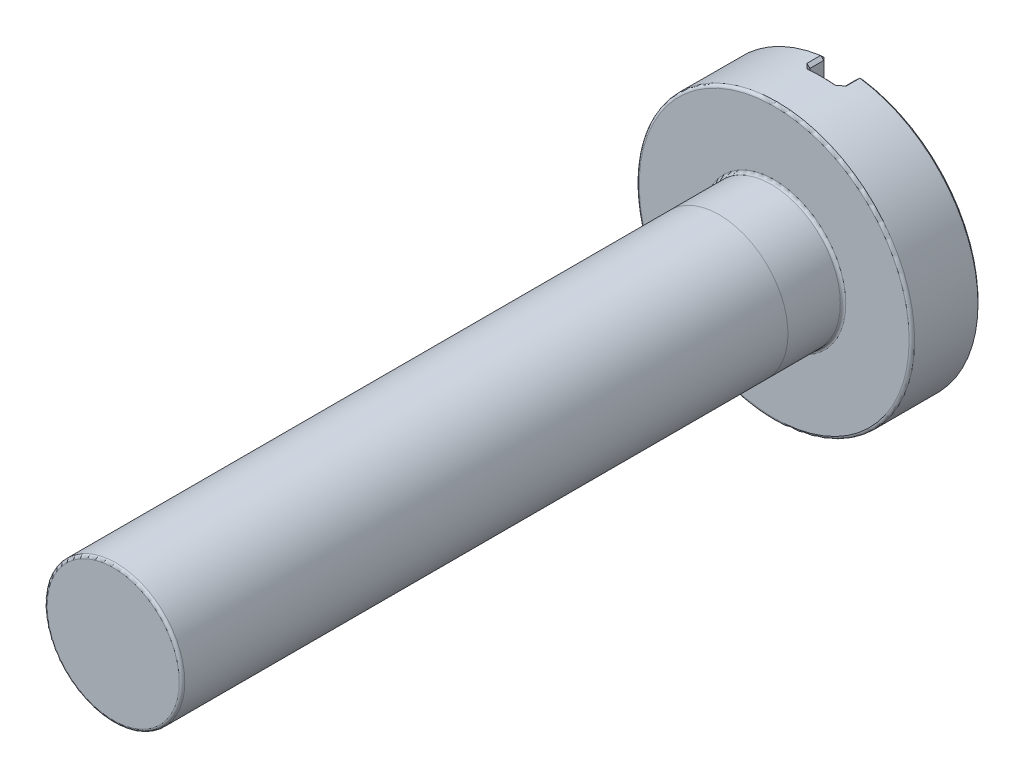
ISO-10303-21;
HEADER;
FILE_DESCRIPTION(('STEP AP214'),'2;1');
FILE_NAME('part.step','',(''),(''),'','','');
FILE_SCHEMA(('AUTOMOTIVE_DESIGN { 1 0 10303 214 1 1 1 1 }'));
ENDSEC;
DATA;
#1=APPLICATION_CONTEXT('core data for automotive mechanical design processes');
#2=APPLICATION_PROTOCOL_DEFINITION('international standard','automotive_design',2000,#1);
#3=PRODUCT_CONTEXT('',#1,'mechanical');
#4=PRODUCT('Part','Part','',(#3));
#5=PRODUCT_RELATED_PRODUCT_CATEGORY('part','',(#4));
#6=PRODUCT_DEFINITION_FORMATION('','',#4);
#7=PRODUCT_DEFINITION_CONTEXT('part definition',#1,'design');
#8=PRODUCT_DEFINITION('design','',#6,#7);
#9=PRODUCT_DEFINITION_SHAPE('','',#8);
#10=(LENGTH_UNIT() NAMED_UNIT(*) SI_UNIT(.MILLI.,.METRE.));
#11=(NAMED_UNIT(*) PLANE_ANGLE_UNIT() SI_UNIT($,.RADIAN.));
#12=(NAMED_UNIT(*) SI_UNIT($,.STERADIAN.) SOLID_ANGLE_UNIT());
#13=UNCERTAINTY_MEASURE_WITH_UNIT(LENGTH_MEASURE(1.E-05),#10,'distance_accuracy_value','');
#14=(GEOMETRIC_REPRESENTATION_CONTEXT(3) GLOBAL_UNCERTAINTY_ASSIGNED_CONTEXT((#13)) GLOBAL_UNIT_ASSIGNED_CONTEXT((#10,
#11,#12)) REPRESENTATION_CONTEXT('',''));
#15=CARTESIAN_POINT('',(0.,0.,0.));
#16=DIRECTION('',(0.,0.,1.));
#17=DIRECTION('',(1.,0.,0.));
#18=AXIS2_PLACEMENT_3D('',#15,#16,#17);
#19=CARTESIAN_POINT('',(0.,0.,12.));
#20=DIRECTION('',(0.,0.,-1.));
#21=DIRECTION('',(-1.,0.,0.));
#22=AXIS2_PLACEMENT_3D('',#19,#20,#21);
#23=CYLINDRICAL_SURFACE('',#22,1.25);
#24=CARTESIAN_POINT('',(0.,0.,11.95));
#25=DIRECTION('',(0.,0.,1.));
#26=DIRECTION('',(1.,0.,0.));
#27=AXIS2_PLACEMENT_3D('',#24,#25,#26);
#28=CIRCLE('',#27,1.25);
#29=CARTESIAN_POINT('',(1.25,0.,11.95));
#30=VERTEX_POINT('',#29);
#31=EDGE_CURVE('E55',#30,#30,#28,.F.);
#32=ORIENTED_EDGE('',*,*,#31,.T.);
#33=EDGE_LOOP('',(#32));
#34=FACE_BOUND('',#33,.T.);
#35=CARTESIAN_POINT('',(0.,0.,1.));
#36=DIRECTION('',(0.,0.,-1.));
#37=DIRECTION('',(0.,1.,0.));
#38=AXIS2_PLACEMENT_3D('',#35,#36,#37);
#39=CIRCLE('',#38,1.25);
#40=CARTESIAN_POINT('',(0.,1.25,1.));
#41=VERTEX_POINT('',#40);
#42=EDGE_CURVE('E11',#41,#41,#39,.T.);
#43=ORIENTED_EDGE('',*,*,#42,.F.);
#44=EDGE_LOOP('',(#43));
#45=FACE_BOUND('',#44,.T.);
#46=ADVANCED_FACE('F46',(#34,#45),#23,.T.);
#47=CARTESIAN_POINT('',(0.,0.,-1.25));
#48=DIRECTION('',(0.,0.,1.));
#49=DIRECTION('',(1.,0.,0.));
#50=AXIS2_PLACEMENT_3D('',#47,#48,#49);
#51=CYLINDRICAL_SURFACE('',#50,2.5);
#52=CARTESIAN_POINT('',(0.,0.,-0.0499999999999999));
#53=DIRECTION('',(0.,0.,1.));
#54=DIRECTION('',(1.,0.,0.));
#55=AXIS2_PLACEMENT_3D('',#52,#53,#54);
#56=CIRCLE('',#55,2.5);
#57=CARTESIAN_POINT('',(2.5,0.,-0.0499999999999999));
#58=VERTEX_POINT('',#57);
#59=EDGE_CURVE('E514',#58,#58,#56,.F.);
#60=ORIENTED_EDGE('',*,*,#59,.T.);
#61=EDGE_LOOP('',(#60));
#62=FACE_BOUND('',#61,.T.);
#63=CARTESIAN_POINT('',(-0.357142857142859,2.47435829652697,-0.950000000000001));
#64=CARTESIAN_POINT('',(-0.348283128722045,2.47563702333072,-0.941134122382787));
#65=CARTESIAN_POINT('',(-0.339398611806157,2.47687086598076,-0.932286484523355));
#66=CARTESIAN_POINT('',(-0.321576086205338,2.47924782192304,-0.914632993380492));
#67=CARTESIAN_POINT('',(-0.312638077482019,2.48039093515016,-0.905827140127055));
#68=CARTESIAN_POINT('',(-0.287577804069123,2.48345759248477,-0.881282240398703));
#69=CARTESIAN_POINT('',(-0.271391793277397,2.48527929599137,-0.865595509519482));
#70=CARTESIAN_POINT('',(-0.25510204081875,2.48695053203223,-0.850000000001686));
#71=B_SPLINE_CURVE_WITH_KNOTS('',3,(#63,#64,#65,#66,#67,#68,#69,#70),.UNSPECIFIED.,.F.,.F.,(4,2,
2,4),(0.,0.0377968117810585,0.0755936506896943,0.143431941871321),.UNSPECIFIED.);
#72=CARTESIAN_POINT('',(-0.357142857142859,2.47435829652697,-0.950000000000001));
#73=VERTEX_POINT('',#72);
#74=CARTESIAN_POINT('',(-0.255102040816325,2.48695053203142,-0.849999999999999));
#75=VERTEX_POINT('',#74);
#76=EDGE_CURVE('E261',#73,#75,#71,.T.);
#77=ORIENTED_EDGE('',*,*,#76,.F.);
#78=DIRECTION('',(0.,0.,1.));
#79=VECTOR('',#78,1.);
#80=CARTESIAN_POINT('',(-0.357142857142859,2.47435829652697,-1.25));
#81=LINE('',#80,#79);
#82=CARTESIAN_POINT('',(-0.357142857142859,2.47435829652697,-1.2));
#83=VERTEX_POINT('',#82);
#84=EDGE_CURVE('E259',#73,#83,#81,.F.);
#85=ORIENTED_EDGE('',*,*,#84,.T.);
#86=CARTESIAN_POINT('',(0.,0.,-1.2));
#87=DIRECTION('',(0.,0.,1.));
#88=DIRECTION('',(1.,0.,0.));
#89=AXIS2_PLACEMENT_3D('',#86,#87,#88);
#90=CIRCLE('',#89,2.5);
#91=CARTESIAN_POINT('',(-0.357142857142859,-2.47435829652697,-1.2));
#92=VERTEX_POINT('',#91);
#93=EDGE_CURVE('E255',#83,#92,#90,.T.);
#94=ORIENTED_EDGE('',*,*,#93,.T.);
#95=DIRECTION('',(0.,0.,1.));
#96=VECTOR('',#95,1.);
#97=CARTESIAN_POINT('',(-0.357142857142859,-2.47435829652697,-1.25));
#98=LINE('',#97,#96);
#99=CARTESIAN_POINT('',(-0.357142857142859,-2.47435829652697,-0.950000000000001));
#100=VERTEX_POINT('',#99);
#101=EDGE_CURVE('E155',#92,#100,#98,.T.);
#102=ORIENTED_EDGE('',*,*,#101,.T.);
#103=CARTESIAN_POINT('',(-0.255102040816325,-2.48695053203142,-0.849999999999999));
#104=CARTESIAN_POINT('',(-0.264178191386565,-2.48601946587719,-0.858688711502498));
#105=CARTESIAN_POINT('',(-0.273221965792444,-2.48504163410855,-0.86740607020343));
#106=CARTESIAN_POINT('',(-0.291248879878858,-2.4829934567889,-0.884892451642306));
#107=CARTESIAN_POINT('',(-0.300232019629449,-2.4819231113448,-0.893661474320537));
#108=CARTESIAN_POINT('',(-0.325259245581334,-2.47880383809922,-0.918233587454576));
#109=CARTESIAN_POINT('',(-0.34124058304598,-2.47665328543805,-0.934087828582102));
#110=CARTESIAN_POINT('',(-0.357142857142859,-2.47435829652697,-0.950000000000001));
#111=B_SPLINE_CURVE_WITH_KNOTS('',3,(#103,#104,#105,#106,#107,#108,#109,#110),.UNSPECIFIED.,.F.,
.F.,(4,2,2,4),(0.,0.0377969208692554,0.0755937980612079,0.143432033029298),.UNSPECIFIED.);
#112=CARTESIAN_POINT('',(-0.255102040816325,-2.48695053203142,-0.849999999999999));
#113=VERTEX_POINT('',#112);
#114=EDGE_CURVE('E247',#113,#100,#111,.T.);
#115=ORIENTED_EDGE('',*,*,#114,.F.);
#116=CARTESIAN_POINT('',(0.,0.,-0.849999999999999));
#117=DIRECTION('',(0.,0.,-1.));
#118=DIRECTION('',(-1.,0.,0.));
#119=AXIS2_PLACEMENT_3D('',#116,#117,#118);
#120=CIRCLE('',#119,2.5);
#121=CARTESIAN_POINT('',(0.255102040816325,-2.48695053203142,-0.849999999999999));
#122=VERTEX_POINT('',#121);
#123=EDGE_CURVE('E203',#113,#122,#120,.F.);
#124=ORIENTED_EDGE('',*,*,#123,.T.);
#125=CARTESIAN_POINT('',(0.357142857142859,-2.47435829652697,-0.950000000000001));
#126=CARTESIAN_POINT('',(0.348283128722045,-2.47563702333072,-0.941134122382787));
#127=CARTESIAN_POINT('',(0.339398611806157,-2.47687086598076,-0.932286484523355));
#128=CARTESIAN_POINT('',(0.321576086205338,-2.47924782192304,-0.914632993380492));
#129=CARTESIAN_POINT('',(0.312638077482019,-2.48039093515016,-0.905827140127055));
#130=CARTESIAN_POINT('',(0.287577804069123,-2.48345759248477,-0.881282240398703));
#131=CARTESIAN_POINT('',(0.271391793277397,-2.48527929599137,-0.865595509519482));
#132=CARTESIAN_POINT('',(0.25510204081875,-2.48695053203223,-0.850000000001686));
#133=B_SPLINE_CURVE_WITH_KNOTS('',3,(#125,#126,#127,#128,#129,#130,#131,#132),.UNSPECIFIED.,.F.,
.F.,(4,2,2,4),(0.,0.0377968117810585,0.0755936506896943,0.143431941871321),.UNSPECIFIED.);
#134=CARTESIAN_POINT('',(0.357142857142859,-2.47435829652697,-0.950000000000001));
#135=VERTEX_POINT('',#134);
#136=EDGE_CURVE('E194',#135,#122,#133,.T.);
#137=ORIENTED_EDGE('',*,*,#136,.F.);
#138=DIRECTION('',(0.,0.,1.));
#139=VECTOR('',#138,1.);
#140=CARTESIAN_POINT('',(0.357142857142859,-2.47435829652697,-1.25));
#141=LINE('',#140,#139);
#142=CARTESIAN_POINT('',(0.357142857142859,-2.47435829652697,-1.2));
#143=VERTEX_POINT('',#142);
#144=EDGE_CURVE('E192',#135,#143,#141,.F.);
#145=ORIENTED_EDGE('',*,*,#144,.T.);
#146=CARTESIAN_POINT('',(0.,0.,-1.2));
#147=DIRECTION('',(0.,0.,1.));
#148=DIRECTION('',(1.,0.,0.));
#149=AXIS2_PLACEMENT_3D('',#146,#147,#148);
#150=CIRCLE('',#149,2.5);
#151=CARTESIAN_POINT('',(0.357142857142859,2.47435829652697,-1.2));
#152=VERTEX_POINT('',#151);
#153=EDGE_CURVE('E185',#143,#152,#150,.T.);
#154=ORIENTED_EDGE('',*,*,#153,.T.);
#155=DIRECTION('',(0.,0.,1.));
#156=VECTOR('',#155,1.);
#157=CARTESIAN_POINT('',(0.357142857142859,2.47435829652697,-1.25));
#158=LINE('',#157,#156);
#159=CARTESIAN_POINT('',(0.357142857142859,2.47435829652697,-0.950000000000001));
#160=VERTEX_POINT('',#159);
#161=EDGE_CURVE('E190',#152,#160,#158,.T.);
#162=ORIENTED_EDGE('',*,*,#161,.T.);
#163=CARTESIAN_POINT('',(0.255102040816325,2.48695053203142,-0.849999999999999));
#164=CARTESIAN_POINT('',(0.264178191386565,2.48601946587719,-0.858688711502498));
#165=CARTESIAN_POINT('',(0.273221965792444,2.48504163410855,-0.86740607020343));
#166=CARTESIAN_POINT('',(0.291248879878858,2.4829934567889,-0.884892451642306));
#167=CARTESIAN_POINT('',(0.300232019629449,2.4819231113448,-0.893661474320537));
#168=CARTESIAN_POINT('',(0.325259245581334,2.47880383809922,-0.918233587454576));
#169=CARTESIAN_POINT('',(0.34124058304598,2.47665328543805,-0.934087828582102));
#170=CARTESIAN_POINT('',(0.357142857142859,2.47435829652697,-0.950000000000001));
#171=B_SPLINE_CURVE_WITH_KNOTS('',3,(#163,#164,#165,#166,#167,#168,#169,#170),.UNSPECIFIED.,.F.,
.F.,(4,2,2,4),(0.,0.0377969208692554,0.0755937980612079,0.143432033029298),.UNSPECIFIED.);
#172=CARTESIAN_POINT('',(0.255102040816325,2.48695053203142,-0.849999999999999));
#173=VERTEX_POINT('',#172);
#174=EDGE_CURVE('E240',#173,#160,#171,.T.);
#175=ORIENTED_EDGE('',*,*,#174,.F.);
#176=CARTESIAN_POINT('',(0.,0.,-0.849999999999999));
#177=DIRECTION('',(0.,0.,-1.));
#178=DIRECTION('',(-1.,0.,0.));
#179=AXIS2_PLACEMENT_3D('',#176,#177,#178);
#180=CIRCLE('',#179,2.5);
#181=EDGE_CURVE('E257',#173,#75,#180,.F.);
#182=ORIENTED_EDGE('',*,*,#181,.T.);
#183=EDGE_LOOP('',(#77,#85,#94,#102,#115,#124,#137,#145,#154,#162,#175,#182));
#184=FACE_BOUND('',#183,.T.);
#185=ADVANCED_FACE('F205',(#62,#184),#51,.T.);
#186=CARTESIAN_POINT('',(0.,0.,-1.25));
#187=DIRECTION('',(0.,0.,1.));
#188=DIRECTION('',(1.,0.,0.));
#189=AXIS2_PLACEMENT_3D('',#186,#187,#188);
#190=PLANE('',#189);
#191=CARTESIAN_POINT('',(0.,0.,-1.25));
#192=DIRECTION('',(0.,0.,1.));
#193=DIRECTION('',(1.,0.,0.));
#194=AXIS2_PLACEMENT_3D('',#191,#192,#193);
#195=CIRCLE('',#194,2.45);
#196=CARTESIAN_POINT('',(0.350000000000001,2.42487113059643,-1.25));
#197=VERTEX_POINT('',#196);
#198=CARTESIAN_POINT('',(0.350000000000001,-2.42487113059643,-1.25));
#199=VERTEX_POINT('',#198);
#200=EDGE_CURVE('E61',#197,#199,#195,.F.);
#201=ORIENTED_EDGE('',*,*,#200,.T.);
#202=DIRECTION('',(0.,1.,0.));
#203=VECTOR('',#202,1.);
#204=CARTESIAN_POINT('',(0.350000000000001,0.,-1.25));
#205=LINE('',#204,#203);
#206=EDGE_CURVE('E530',#199,#197,#205,.T.);
#207=ORIENTED_EDGE('',*,*,#206,.T.);
#208=EDGE_LOOP('',(#201,#207));
#209=FACE_BOUND('',#208,.T.);
#210=ADVANCED_FACE('F494',(#209),#190,.F.);
#211=ORIENTED_EDGE('',*,*,#42,.T.);
#212=EDGE_LOOP('',(#211));
#213=FACE_BOUND('',#212,.T.);
#214=CARTESIAN_POINT('',(0.,0.,0.0499999999999997));
#215=DIRECTION('',(0.,0.,1.));
#216=DIRECTION('',(1.,0.,0.));
#217=AXIS2_PLACEMENT_3D('',#214,#215,#216);
#218=CIRCLE('',#217,1.25);
#219=CARTESIAN_POINT('',(1.25,0.,0.0499999999999997));
#220=VERTEX_POINT('',#219);
#221=EDGE_CURVE('E512',#220,#220,#218,.T.);
#222=ORIENTED_EDGE('',*,*,#221,.T.);
#223=EDGE_LOOP('',(#222));
#224=FACE_BOUND('',#223,.T.);
#225=ADVANCED_FACE('F218',(#213,#224),#23,.T.);
#226=CARTESIAN_POINT('',(0.,0.,12.));
#227=DIRECTION('',(0.,0.,1.));
#228=DIRECTION('',(1.,0.,0.));
#229=AXIS2_PLACEMENT_3D('',#226,#227,#228);
#230=PLANE('',#229);
#231=CARTESIAN_POINT('',(0.,0.,12.));
#232=DIRECTION('',(0.,0.,1.));
#233=DIRECTION('',(1.,0.,0.));
#234=AXIS2_PLACEMENT_3D('',#231,#232,#233);
#235=CIRCLE('',#234,1.2);
#236=CARTESIAN_POINT('',(1.2,0.,12.));
#237=VERTEX_POINT('',#236);
#238=EDGE_CURVE('E513',#237,#237,#235,.T.);
#239=ORIENTED_EDGE('',*,*,#238,.T.);
#240=EDGE_LOOP('',(#239));
#241=FACE_BOUND('',#240,.T.);
#242=ADVANCED_FACE('F499',(#241),#230,.T.);
#243=CARTESIAN_POINT('',(0.,0.,-1.25));
#244=DIRECTION('',(0.,0.,1.));
#245=DIRECTION('',(1.,0.,0.));
#246=AXIS2_PLACEMENT_3D('',#243,#244,#245);
#247=CIRCLE('',#246,2.45);
#248=CARTESIAN_POINT('',(-0.350000000000001,-2.42487113059643,-1.25));
#249=VERTEX_POINT('',#248);
#250=CARTESIAN_POINT('',(-0.350000000000001,2.42487113059643,-1.25));
#251=VERTEX_POINT('',#250);
#252=EDGE_CURVE('E593',#249,#251,#247,.F.);
#253=ORIENTED_EDGE('',*,*,#252,.T.);
#254=DIRECTION('',(0.,-1.,0.));
#255=VECTOR('',#254,1.);
#256=CARTESIAN_POINT('',(-0.350000000000001,0.,-1.25));
#257=LINE('',#256,#255);
#258=EDGE_CURVE('E600',#251,#249,#257,.T.);
#259=ORIENTED_EDGE('',*,*,#258,.T.);
#260=EDGE_LOOP('',(#253,#259));
#261=FACE_BOUND('',#260,.T.);
#262=ADVANCED_FACE('F505',(#261),#190,.F.);
#263=CARTESIAN_POINT('',(0.,0.,0.));
#264=DIRECTION('',(0.,0.,1.));
#265=DIRECTION('',(1.,0.,0.));
#266=AXIS2_PLACEMENT_3D('',#263,#264,#265);
#267=PLANE('',#266);
#268=CARTESIAN_POINT('',(0.,0.,0.));
#269=DIRECTION('',(0.,0.,1.));
#270=DIRECTION('',(1.,0.,0.));
#271=AXIS2_PLACEMENT_3D('',#268,#269,#270);
#272=CIRCLE('',#271,2.45);
#273=CARTESIAN_POINT('',(2.45,0.,0.));
#274=VERTEX_POINT('',#273);
#275=EDGE_CURVE('E519',#274,#274,#272,.T.);
#276=ORIENTED_EDGE('',*,*,#275,.T.);
#277=EDGE_LOOP('',(#276));
#278=FACE_BOUND('',#277,.T.);
#279=CARTESIAN_POINT('',(0.,0.,0.));
#280=DIRECTION('',(0.,0.,1.));
#281=DIRECTION('',(1.,0.,0.));
#282=AXIS2_PLACEMENT_3D('',#279,#280,#281);
#283=CIRCLE('',#282,1.3);
#284=CARTESIAN_POINT('',(1.3,0.,0.));
#285=VERTEX_POINT('',#284);
#286=EDGE_CURVE('E527',#285,#285,#283,.F.);
#287=ORIENTED_EDGE('',*,*,#286,.T.);
#288=EDGE_LOOP('',(#287));
#289=FACE_BOUND('',#288,.T.);
#290=ADVANCED_FACE('F617',(#278,#289),#267,.T.);
#291=CARTESIAN_POINT('',(0.3,-3.72872824867462,-0.9));
#292=DIRECTION('',(1.,0.,0.));
#293=DIRECTION('',(0.,0.,-1.));
#294=AXIS2_PLACEMENT_3D('',#291,#292,#293);
#295=PLANE('',#294);
#296=DIRECTION('',(0.,0.,1.));
#297=VECTOR('',#296,1.);
#298=CARTESIAN_POINT('',(0.3,-2.42487113059643,-0.9));
#299=LINE('',#298,#297);
#300=CARTESIAN_POINT('',(0.3,-2.42487113059643,-1.2));
#301=VERTEX_POINT('',#300);
#302=CARTESIAN_POINT('',(0.3,-2.42487113059643,-0.950000000000001));
#303=VERTEX_POINT('',#302);
#304=EDGE_CURVE('E554',#301,#303,#299,.T.);
#305=ORIENTED_EDGE('',*,*,#304,.T.);
#306=DIRECTION('',(0.,1.,0.));
#307=VECTOR('',#306,1.);
#308=CARTESIAN_POINT('',(0.3,-3.72872824867462,-0.950000000000001));
#309=LINE('',#308,#307);
#310=CARTESIAN_POINT('',(0.3,2.42487113059643,-0.950000000000001));
#311=VERTEX_POINT('',#310);
#312=EDGE_CURVE('E955',#303,#311,#309,.T.);
#313=ORIENTED_EDGE('',*,*,#312,.T.);
#314=DIRECTION('',(0.,0.,-1.));
#315=VECTOR('',#314,1.);
#316=CARTESIAN_POINT('',(0.3,2.42487113059643,-1.25));
#317=LINE('',#316,#315);
#318=CARTESIAN_POINT('',(0.3,2.42487113059643,-1.2));
#319=VERTEX_POINT('',#318);
#320=EDGE_CURVE('E958',#311,#319,#317,.T.);
#321=ORIENTED_EDGE('',*,*,#320,.T.);
#322=DIRECTION('',(0.,-1.,0.));
#323=VECTOR('',#322,1.);
#324=CARTESIAN_POINT('',(0.3,-3.72872824867462,-1.2));
#325=LINE('',#324,#323);
#326=EDGE_CURVE('E268',#319,#301,#325,.T.);
#327=ORIENTED_EDGE('',*,*,#326,.T.);
#328=EDGE_LOOP('',(#305,#313,#321,#327));
#329=FACE_BOUND('',#328,.T.);
#330=ADVANCED_FACE('F621',(#329),#295,.F.);
#331=CARTESIAN_POINT('',(-0.3,-3.72872824867462,-0.9));
#332=DIRECTION('',(-1.,0.,0.));
#333=DIRECTION('',(0.,0.,1.));
#334=AXIS2_PLACEMENT_3D('',#331,#332,#333);
#335=PLANE('',#334);
#336=DIRECTION('',(0.,0.,1.));
#337=VECTOR('',#336,1.);
#338=CARTESIAN_POINT('',(-0.3,2.42487113059643,-0.9));
#339=LINE('',#338,#337);
#340=CARTESIAN_POINT('',(-0.3,2.42487113059643,-1.2));
#341=VERTEX_POINT('',#340);
#342=CARTESIAN_POINT('',(-0.3,2.42487113059643,-0.950000000000001));
#343=VERTEX_POINT('',#342);
#344=EDGE_CURVE('E177',#341,#343,#339,.T.);
#345=ORIENTED_EDGE('',*,*,#344,.T.);
#346=DIRECTION('',(0.,-1.,0.));
#347=VECTOR('',#346,1.);
#348=CARTESIAN_POINT('',(-0.3,-3.72872824867462,-0.950000000000001));
#349=LINE('',#348,#347);
#350=CARTESIAN_POINT('',(-0.3,-2.42487113059643,-0.950000000000001));
#351=VERTEX_POINT('',#350);
#352=EDGE_CURVE('E182',#343,#351,#349,.T.);
#353=ORIENTED_EDGE('',*,*,#352,.T.);
#354=DIRECTION('',(0.,0.,-1.));
#355=VECTOR('',#354,1.);
#356=CARTESIAN_POINT('',(-0.3,-2.42487113059643,-1.25));
#357=LINE('',#356,#355);
#358=CARTESIAN_POINT('',(-0.3,-2.42487113059643,-1.2));
#359=VERTEX_POINT('',#358);
#360=EDGE_CURVE('E153',#351,#359,#357,.T.);
#361=ORIENTED_EDGE('',*,*,#360,.T.);
#362=DIRECTION('',(0.,1.,0.));
#363=VECTOR('',#362,1.);
#364=CARTESIAN_POINT('',(-0.3,-3.72872824867462,-1.2));
#365=LINE('',#364,#363);
#366=EDGE_CURVE('E171',#359,#341,#365,.T.);
#367=ORIENTED_EDGE('',*,*,#366,.T.);
#368=EDGE_LOOP('',(#345,#353,#361,#367));
#369=FACE_BOUND('',#368,.T.);
#370=ADVANCED_FACE('F180',(#369),#335,.F.);
#371=CARTESIAN_POINT('',(0.,0.,-0.9));
#372=DIRECTION('',(0.,0.,-1.));
#373=DIRECTION('',(-1.,0.,0.));
#374=AXIS2_PLACEMENT_3D('',#371,#372,#373);
#375=PLANE('',#374);
#376=DIRECTION('',(0.,-1.,0.));
#377=VECTOR('',#376,1.);
#378=CARTESIAN_POINT('',(0.249999999999999,0.,-0.9));
#379=LINE('',#378,#377);
#380=CARTESIAN_POINT('',(0.249999999999999,2.43721152139079,-0.9));
#381=VERTEX_POINT('',#380);
#382=CARTESIAN_POINT('',(0.249999999999999,-2.43721152139079,-0.9));
#383=VERTEX_POINT('',#382);
#384=EDGE_CURVE('E590',#381,#383,#379,.T.);
#385=ORIENTED_EDGE('',*,*,#384,.T.);
#386=CARTESIAN_POINT('',(0.,0.,-0.9));
#387=DIRECTION('',(0.,0.,-1.));
#388=DIRECTION('',(-1.,0.,0.));
#389=AXIS2_PLACEMENT_3D('',#386,#387,#388);
#390=CIRCLE('',#389,2.45);
#391=CARTESIAN_POINT('',(-0.249999999999999,-2.43721152139079,-0.9));
#392=VERTEX_POINT('',#391);
#393=EDGE_CURVE('E569',#383,#392,#390,.T.);
#394=ORIENTED_EDGE('',*,*,#393,.T.);
#395=DIRECTION('',(0.,1.,0.));
#396=VECTOR('',#395,1.);
#397=CARTESIAN_POINT('',(-0.249999999999999,0.,-0.9));
#398=LINE('',#397,#396);
#399=CARTESIAN_POINT('',(-0.249999999999999,2.43721152139079,-0.9));
#400=VERTEX_POINT('',#399);
#401=EDGE_CURVE('E595',#392,#400,#398,.T.);
#402=ORIENTED_EDGE('',*,*,#401,.T.);
#403=CARTESIAN_POINT('',(0.,0.,-0.9));
#404=DIRECTION('',(0.,0.,-1.));
#405=DIRECTION('',(-1.,0.,0.));
#406=AXIS2_PLACEMENT_3D('',#403,#404,#405);
#407=CIRCLE('',#406,2.45);
#408=EDGE_CURVE('E587',#400,#381,#407,.T.);
#409=ORIENTED_EDGE('',*,*,#408,.T.);
#410=EDGE_LOOP('',(#385,#394,#402,#409));
#411=FACE_BOUND('',#410,.T.);
#412=ADVANCED_FACE('F476',(#411),#375,.T.);
#413=CARTESIAN_POINT('',(0.3,2.42487113059643,-1.2));
#414=DIRECTION('',(-0.547722557505162,0.632455532033675,-0.547722557505171));
#415=DIRECTION('',(0.,0.654653670707981,0.755928946018451));
#416=AXIS2_PLACEMENT_3D('',#413,#414,#415);
#417=PLANE('',#416);
#418=DIRECTION('',(0.755928946018456,0.654653670707975,0.));
#419=VECTOR('',#418,1.);
#420=CARTESIAN_POINT('',(0.3,2.42487113059643,-1.2));
#421=LINE('',#420,#419);
#422=EDGE_CURVE('E535',#152,#319,#421,.F.);
#423=ORIENTED_EDGE('',*,*,#422,.F.);
#424=DIRECTION('',(-0.101015254455233,-0.699854212223773,-0.707106781186538));
#425=VECTOR('',#424,1.);
#426=CARTESIAN_POINT('',(0.,0.,-3.69999999999995));
#427=LINE('',#426,#425);
#428=EDGE_CURVE('E178',#197,#152,#427,.F.);
#429=ORIENTED_EDGE('',*,*,#428,.F.);
#430=DIRECTION('',(0.707106781186557,0.,-0.707106781186538));
#431=VECTOR('',#430,1.);
#432=CARTESIAN_POINT('',(0.3,2.42487113059643,-1.2));
#433=LINE('',#432,#431);
#434=EDGE_CURVE('E532',#319,#197,#433,.T.);
#435=ORIENTED_EDGE('',*,*,#434,.F.);
#436=EDGE_LOOP('',(#423,#429,#435));
#437=FACE_BOUND('',#436,.T.);
#438=ADVANCED_FACE('F471',(#437),#417,.T.);
#439=CARTESIAN_POINT('',(0.,0.,-1.2));
#440=DIRECTION('',(0.,0.,1.));
#441=DIRECTION('',(1.,0.,0.));
#442=AXIS2_PLACEMENT_3D('',#439,#440,#441);
#443=CONICAL_SURFACE('',#442,2.5,0.785398163397461);
#444=ORIENTED_EDGE('',*,*,#428,.T.);
#445=ORIENTED_EDGE('',*,*,#153,.F.);
#446=DIRECTION('',(0.101015254455233,-0.699854212223773,0.707106781186538));
#447=VECTOR('',#446,1.);
#448=CARTESIAN_POINT('',(0.,0.,-3.69999999999995));
#449=LINE('',#448,#447);
#450=EDGE_CURVE('E538',#199,#143,#449,.T.);
#451=ORIENTED_EDGE('',*,*,#450,.F.);
#452=ORIENTED_EDGE('',*,*,#200,.F.);
#453=EDGE_LOOP('',(#444,#445,#451,#452));
#454=FACE_BOUND('',#453,.T.);
#455=ADVANCED_FACE('F465',(#454),#443,.T.);
#456=CARTESIAN_POINT('',(0.350000000000001,0.,-1.25));
#457=DIRECTION('',(0.707106781186538,0.,0.707106781186557));
#458=DIRECTION('',(0.,1.,0.));
#459=AXIS2_PLACEMENT_3D('',#456,#457,#458);
#460=PLANE('',#459);
#461=ORIENTED_EDGE('',*,*,#434,.T.);
#462=ORIENTED_EDGE('',*,*,#206,.F.);
#463=DIRECTION('',(-0.707106781186557,0.,0.707106781186538));
#464=VECTOR('',#463,1.);
#465=CARTESIAN_POINT('',(0.32857142857143,-2.42487113059643,-1.22857142857143));
#466=LINE('',#465,#464);
#467=EDGE_CURVE('E541',#301,#199,#466,.F.);
#468=ORIENTED_EDGE('',*,*,#467,.F.);
#469=ORIENTED_EDGE('',*,*,#326,.F.);
#470=EDGE_LOOP('',(#461,#462,#468,#469));
#471=FACE_BOUND('',#470,.T.);
#472=ADVANCED_FACE('F458',(#471),#460,.F.);
#473=CARTESIAN_POINT('',(0.3,2.42487113059643,-1.25));
#474=DIRECTION('',(-0.654653670707975,0.755928946018456,0.));
#475=DIRECTION('',(0.,0.,1.));
#476=AXIS2_PLACEMENT_3D('',#473,#474,#475);
#477=PLANE('',#476);
#478=ORIENTED_EDGE('',*,*,#422,.T.);
#479=ORIENTED_EDGE('',*,*,#320,.F.);
#480=DIRECTION('',(-0.755928946018456,-0.654653670707975,0.));
#481=VECTOR('',#480,1.);
#482=CARTESIAN_POINT('',(0.357142857142859,2.47435829652697,-0.950000000000001));
#483=LINE('',#482,#481);
#484=EDGE_CURVE('E543',#160,#311,#483,.T.);
#485=ORIENTED_EDGE('',*,*,#484,.F.);
#486=ORIENTED_EDGE('',*,*,#161,.F.);
#487=EDGE_LOOP('',(#478,#479,#485,#486));
#488=FACE_BOUND('',#487,.T.);
#489=ADVANCED_FACE('F451',(#488),#477,.T.);
#490=CARTESIAN_POINT('',(0.357142857142859,-2.47435829652697,-1.2));
#491=DIRECTION('',(-0.547722557505162,-0.632455532033675,-0.547722557505171));
#492=DIRECTION('',(0.,0.654653670707981,-0.755928946018451));
#493=AXIS2_PLACEMENT_3D('',#490,#491,#492);
#494=PLANE('',#493);
#495=ORIENTED_EDGE('',*,*,#467,.T.);
#496=ORIENTED_EDGE('',*,*,#450,.T.);
#497=DIRECTION('',(0.755928946018456,-0.654653670707975,0.));
#498=VECTOR('',#497,1.);
#499=CARTESIAN_POINT('',(0.357142857142859,-2.47435829652697,-1.2));
#500=LINE('',#499,#498);
#501=EDGE_CURVE('E406',#301,#143,#500,.T.);
#502=ORIENTED_EDGE('',*,*,#501,.F.);
#503=EDGE_LOOP('',(#495,#496,#502));
#504=FACE_BOUND('',#503,.T.);
#505=ADVANCED_FACE('F439',(#504),#494,.T.);
#506=CARTESIAN_POINT('',(0.249999999999999,2.43721152139079,-0.9));
#507=CARTESIAN_POINT('',(0.3,2.42487113059643,-0.950000000000001));
#508=CARTESIAN_POINT('',(0.255102040816325,2.48695053203142,-0.849999999999999));
#509=CARTESIAN_POINT('',(0.357142857142859,2.47435829652697,-0.950000000000001));
#510=CARTESIAN_POINT('',(0.255185023576886,2.48775951819188,-0.849186768946505));
#511=CARTESIAN_POINT('',(0.358072264061137,2.47516318652865,-0.950000000000001));
#512=B_SPLINE_SURFACE_WITH_KNOTS('',1,1,((#506,#507),(#508,#509),(#510,#511)),.UNSPECIFIED.,.F.,
.F.,.F.,(2,1,2),(2,2),(0.,1.,1.01626462106986),(0.,1.),.UNSPECIFIED.);
#513=CARTESIAN_POINT('',(0.3,2.42487113059643,-0.950000000000001));
#514=CARTESIAN_POINT('',(0.29561196801493,2.42595413118671,-0.945611968014931));
#515=CARTESIAN_POINT('',(0.291223936029859,2.42703713177698,-0.941223936029861));
#516=CARTESIAN_POINT('',(0.282447872059719,2.42920313295754,-0.932447872059721));
#517=CARTESIAN_POINT('',(0.278059840074649,2.43028613354782,-0.92805984007465));
#518=CARTESIAN_POINT('',(0.265781205393052,2.43331659655566,-0.915781205393053));
#519=CARTESIAN_POINT('',(0.257890602696525,2.43526405897322,-0.907890602696527));
#520=CARTESIAN_POINT('',(0.249999999999999,2.43721152139079,-0.9));
#521=B_SPLINE_CURVE_WITH_KNOTS('',3,(#513,#514,#515,#516,#517,#518,#519,#520),.UNSPECIFIED.,.F.,
.F.,(4,2,2,4),(0.,0.0188982236504619,0.0377964473009237,0.0717794207622061),.UNSPECIFIED.);
#522=EDGE_CURVE('E397',#381,#311,#521,.F.);
#523=DIRECTION('',(0.0721537531822999,0.703415834269961,0.70710678118655));
#524=VECTOR('',#523,1.);
#525=CARTESIAN_POINT('',(0.249999999999999,2.43721152139079,-0.9));
#526=LINE('',#525,#524);
#527=EDGE_CURVE('E407',#173,#381,#526,.F.);
#528=ORIENTED_EDGE('',*,*,#174,.T.);
#529=ORIENTED_EDGE('',*,*,#484,.T.);
#530=ORIENTED_EDGE('',*,*,#522,.F.);
#531=ORIENTED_EDGE('',*,*,#527,.F.);
#532=EDGE_LOOP('',(#528,#529,#530,#531));
#533=FACE_BOUND('',#532,.T.);
#534=ADVANCED_FACE('F430',(#533),#512,.T.);
#535=CARTESIAN_POINT('',(0.3,-2.42487113059643,-1.25));
#536=DIRECTION('',(0.654653670707975,0.755928946018456,0.));
#537=DIRECTION('',(0.,0.,1.));
#538=AXIS2_PLACEMENT_3D('',#535,#536,#537);
#539=PLANE('',#538);
#540=ORIENTED_EDGE('',*,*,#501,.T.);
#541=ORIENTED_EDGE('',*,*,#144,.F.);
#542=DIRECTION('',(0.755928946018456,-0.654653670707975,0.));
#543=VECTOR('',#542,1.);
#544=CARTESIAN_POINT('',(0.3,-2.42487113059643,-0.950000000000001));
#545=LINE('',#544,#543);
#546=EDGE_CURVE('E565',#303,#135,#545,.T.);
#547=ORIENTED_EDGE('',*,*,#546,.F.);
#548=ORIENTED_EDGE('',*,*,#304,.F.);
#549=EDGE_LOOP('',(#540,#541,#547,#548));
#550=FACE_BOUND('',#549,.T.);
#551=ADVANCED_FACE('F381',(#550),#539,.F.);
#552=CARTESIAN_POINT('',(0.249999999999999,0.,-0.9));
#553=DIRECTION('',(0.707106781186548,0.,0.707106781186548));
#554=DIRECTION('',(0.,-1.,0.));
#555=AXIS2_PLACEMENT_3D('',#552,#553,#554);
#556=PLANE('',#555);
#557=ORIENTED_EDGE('',*,*,#522,.T.);
#558=ORIENTED_EDGE('',*,*,#312,.F.);
#559=CARTESIAN_POINT('',(0.249999999999999,-2.43721152139079,-0.9));
#560=CARTESIAN_POINT('',(0.254388031985069,-2.43612852080051,-0.90438803198507));
#561=CARTESIAN_POINT('',(0.258776063970139,-2.43504552021023,-0.90877606397014));
#562=CARTESIAN_POINT('',(0.267552127940279,-2.43287951902967,-0.917552127940281));
#563=CARTESIAN_POINT('',(0.27194015992535,-2.4317965184394,-0.921940159925351));
#564=CARTESIAN_POINT('',(0.284218794606947,-2.42876605543155,-0.934218794606948));
#565=CARTESIAN_POINT('',(0.292109397303473,-2.42681859301399,-0.942109397303475));
#566=CARTESIAN_POINT('',(0.3,-2.42487113059643,-0.950000000000001));
#567=B_SPLINE_CURVE_WITH_KNOTS('',3,(#559,#560,#561,#562,#563,#564,#565,#566),.UNSPECIFIED.,.F.,
.F.,(4,2,2,4),(0.,0.0188982236504619,0.0377964473009237,0.0717794207622061),.UNSPECIFIED.);
#568=EDGE_CURVE('E389',#383,#303,#567,.T.);
#569=ORIENTED_EDGE('',*,*,#568,.F.);
#570=ORIENTED_EDGE('',*,*,#384,.F.);
#571=EDGE_LOOP('',(#557,#558,#569,#570));
#572=FACE_BOUND('',#571,.T.);
#573=ADVANCED_FACE('F368',(#572),#556,.F.);
#574=CARTESIAN_POINT('',(0.,0.,-0.849999999999999));
#575=DIRECTION('',(0.,0.,1.));
#576=DIRECTION('',(1.,0.,0.));
#577=AXIS2_PLACEMENT_3D('',#574,#575,#576);
#578=CONICAL_SURFACE('',#577,2.5,0.785398163397448);
#579=ORIENTED_EDGE('',*,*,#527,.T.);
#580=ORIENTED_EDGE('',*,*,#408,.F.);
#581=DIRECTION('',(0.0721537531822999,-0.703415834269961,-0.70710678118655));
#582=VECTOR('',#581,1.);
#583=CARTESIAN_POINT('',(-0.255102040816325,2.48695053203142,-0.849999999999999));
#584=LINE('',#583,#582);
#585=EDGE_CURVE('E576',#75,#400,#584,.T.);
#586=ORIENTED_EDGE('',*,*,#585,.F.);
#587=ORIENTED_EDGE('',*,*,#181,.F.);
#588=EDGE_LOOP('',(#579,#580,#586,#587));
#589=FACE_BOUND('',#588,.T.);
#590=ADVANCED_FACE('F380',(#589),#578,.T.);
#591=CARTESIAN_POINT('',(-0.3,2.42487113059643,-1.25));
#592=DIRECTION('',(-0.654653670707975,-0.755928946018456,0.));
#593=DIRECTION('',(0.,0.,1.));
#594=AXIS2_PLACEMENT_3D('',#591,#592,#593);
#595=PLANE('',#594);
#596=DIRECTION('',(-0.755928946018456,0.654653670707975,0.));
#597=VECTOR('',#596,1.);
#598=CARTESIAN_POINT('',(-0.357142857142859,2.47435829652697,-1.2));
#599=LINE('',#598,#597);
#600=EDGE_CURVE('E570',#83,#341,#599,.F.);
#601=ORIENTED_EDGE('',*,*,#600,.F.);
#602=ORIENTED_EDGE('',*,*,#84,.F.);
#603=DIRECTION('',(-0.755928946018456,0.654653670707975,0.));
#604=VECTOR('',#603,1.);
#605=CARTESIAN_POINT('',(-0.3,2.42487113059643,-0.950000000000001));
#606=LINE('',#605,#604);
#607=EDGE_CURVE('E572',#343,#73,#606,.T.);
#608=ORIENTED_EDGE('',*,*,#607,.F.);
#609=ORIENTED_EDGE('',*,*,#344,.F.);
#610=EDGE_LOOP('',(#601,#602,#608,#609));
#611=FACE_BOUND('',#610,.T.);
#612=ADVANCED_FACE('F672',(#611),#595,.F.);
#613=CARTESIAN_POINT('',(0.3,-2.42487113059643,-0.950000000000001));
#614=CARTESIAN_POINT('',(0.249999999999999,-2.43721152139079,-0.9));
#615=CARTESIAN_POINT('',(0.357142857142859,-2.47435829652697,-0.950000000000001));
#616=CARTESIAN_POINT('',(0.255102040816325,-2.48695053203142,-0.849999999999999));
#617=CARTESIAN_POINT('',(0.358063042571903,-2.47515520048471,-0.950000000000001));
#618=CARTESIAN_POINT('',(0.255184200229633,-2.48775149150623,-0.849194837749585));
#619=B_SPLINE_SURFACE_WITH_KNOTS('',1,1,((#613,#614),(#615,#616),(#617,#618)),.UNSPECIFIED.,.F.,
.F.,.F.,(2,1,2),(2,2),(0.,1.,1.01610324500827),(0.,1.),.UNSPECIFIED.);
#620=DIRECTION('',(-0.0721537531822999,0.703415834269961,-0.70710678118655));
#621=VECTOR('',#620,1.);
#622=CARTESIAN_POINT('',(0.255102040816325,-2.48695053203142,-0.849999999999999));
#623=LINE('',#622,#621);
#624=EDGE_CURVE('E326',#383,#122,#623,.F.);
#625=ORIENTED_EDGE('',*,*,#546,.T.);
#626=ORIENTED_EDGE('',*,*,#136,.T.);
#627=ORIENTED_EDGE('',*,*,#624,.F.);
#628=ORIENTED_EDGE('',*,*,#568,.T.);
#629=EDGE_LOOP('',(#625,#626,#627,#628));
#630=FACE_BOUND('',#629,.T.);
#631=ADVANCED_FACE('F366',(#630),#619,.T.);
#632=CARTESIAN_POINT('',(-0.3,2.42487113059643,-0.950000000000001));
#633=CARTESIAN_POINT('',(-0.249999999999999,2.43721152139079,-0.9));
#634=CARTESIAN_POINT('',(-0.357142857142859,2.47435829652697,-0.950000000000001));
#635=CARTESIAN_POINT('',(-0.255102040816325,2.48695053203142,-0.849999999999999));
#636=CARTESIAN_POINT('',(-0.358063042571903,2.47515520048471,-0.950000000000001));
#637=CARTESIAN_POINT('',(-0.255184200229633,2.48775149150623,-0.849194837749585));
#638=B_SPLINE_SURFACE_WITH_KNOTS('',1,1,((#632,#633),(#634,#635),(#636,#637)),.UNSPECIFIED.,.F.,
.F.,.F.,(2,1,2),(2,2),(0.,1.,1.01610324500827),(0.,1.),.UNSPECIFIED.);
#639=CARTESIAN_POINT('',(-0.249999999999999,2.43721152139079,-0.9));
#640=CARTESIAN_POINT('',(-0.254388031985069,2.43612852080051,-0.90438803198507));
#641=CARTESIAN_POINT('',(-0.258776063970139,2.43504552021023,-0.90877606397014));
#642=CARTESIAN_POINT('',(-0.267552127940279,2.43287951902967,-0.917552127940281));
#643=CARTESIAN_POINT('',(-0.27194015992535,2.4317965184394,-0.921940159925351));
#644=CARTESIAN_POINT('',(-0.284218794606947,2.42876605543155,-0.934218794606948));
#645=CARTESIAN_POINT('',(-0.292109397303473,2.42681859301399,-0.942109397303475));
#646=CARTESIAN_POINT('',(-0.3,2.42487113059643,-0.950000000000001));
#647=B_SPLINE_CURVE_WITH_KNOTS('',3,(#639,#640,#641,#642,#643,#644,#645,#646),.UNSPECIFIED.,.F.,
.F.,(4,2,2,4),(0.,0.0188982236504619,0.0377964473009237,0.0717794207622061),.UNSPECIFIED.);
#648=EDGE_CURVE('E317',#343,#400,#647,.F.);
#649=ORIENTED_EDGE('',*,*,#76,.T.);
#650=ORIENTED_EDGE('',*,*,#585,.T.);
#651=ORIENTED_EDGE('',*,*,#648,.F.);
#652=ORIENTED_EDGE('',*,*,#607,.T.);
#653=EDGE_LOOP('',(#649,#650,#651,#652));
#654=FACE_BOUND('',#653,.T.);
#655=ADVANCED_FACE('F357',(#654),#638,.T.);
#656=CARTESIAN_POINT('',(-0.357142857142859,2.47435829652697,-1.2));
#657=DIRECTION('',(0.547722557505162,0.632455532033675,-0.547722557505171));
#658=DIRECTION('',(0.,0.654653670707981,0.755928946018451));
#659=AXIS2_PLACEMENT_3D('',#656,#657,#658);
#660=PLANE('',#659);
#661=DIRECTION('',(-0.101015254455233,0.699854212223773,0.707106781186538));
#662=VECTOR('',#661,1.);
#663=CARTESIAN_POINT('',(0.,0.,-3.69999999999995));
#664=LINE('',#663,#662);
#665=EDGE_CURVE('E614',#83,#251,#664,.F.);
#666=ORIENTED_EDGE('',*,*,#665,.F.);
#667=ORIENTED_EDGE('',*,*,#600,.T.);
#668=DIRECTION('',(0.707106781186557,0.,0.707106781186538));
#669=VECTOR('',#668,1.);
#670=CARTESIAN_POINT('',(-0.32857142857143,2.42487113059643,-1.22857142857143));
#671=LINE('',#670,#669);
#672=EDGE_CURVE('E174',#251,#341,#671,.T.);
#673=ORIENTED_EDGE('',*,*,#672,.F.);
#674=EDGE_LOOP('',(#666,#667,#673));
#675=FACE_BOUND('',#674,.T.);
#676=ADVANCED_FACE('F350',(#675),#660,.T.);
#677=CARTESIAN_POINT('',(0.,0.,-0.849999999999999));
#678=DIRECTION('',(0.,0.,1.));
#679=DIRECTION('',(1.,0.,0.));
#680=AXIS2_PLACEMENT_3D('',#677,#678,#679);
#681=CONICAL_SURFACE('',#680,2.5,0.785398163397448);
#682=ORIENTED_EDGE('',*,*,#624,.T.);
#683=ORIENTED_EDGE('',*,*,#123,.F.);
#684=DIRECTION('',(-0.0721537531822999,-0.703415834269961,0.70710678118655));
#685=VECTOR('',#684,1.);
#686=CARTESIAN_POINT('',(-0.249999999999999,-2.43721152139079,-0.9));
#687=LINE('',#686,#685);
#688=EDGE_CURVE('E608',#392,#113,#687,.T.);
#689=ORIENTED_EDGE('',*,*,#688,.F.);
#690=ORIENTED_EDGE('',*,*,#393,.F.);
#691=EDGE_LOOP('',(#682,#683,#689,#690));
#692=FACE_BOUND('',#691,.T.);
#693=ADVANCED_FACE('F303',(#692),#681,.T.);
#694=CARTESIAN_POINT('',(-0.249999999999999,0.,-0.9));
#695=DIRECTION('',(-0.707106781186548,0.,0.707106781186548));
#696=DIRECTION('',(0.,1.,0.));
#697=AXIS2_PLACEMENT_3D('',#694,#695,#696);
#698=PLANE('',#697);
#699=ORIENTED_EDGE('',*,*,#648,.T.);
#700=ORIENTED_EDGE('',*,*,#401,.F.);
#701=CARTESIAN_POINT('',(-0.3,-2.42487113059643,-0.950000000000001));
#702=CARTESIAN_POINT('',(-0.29561196801493,-2.42595413118671,-0.945611968014931));
#703=CARTESIAN_POINT('',(-0.291223936029859,-2.42703713177698,-0.941223936029861));
#704=CARTESIAN_POINT('',(-0.282447872059719,-2.42920313295754,-0.932447872059721));
#705=CARTESIAN_POINT('',(-0.278059840074649,-2.43028613354782,-0.92805984007465));
#706=CARTESIAN_POINT('',(-0.265781205393052,-2.43331659655566,-0.915781205393053));
#707=CARTESIAN_POINT('',(-0.257890602696525,-2.43526405897322,-0.907890602696527));
#708=CARTESIAN_POINT('',(-0.249999999999999,-2.43721152139079,-0.9));
#709=B_SPLINE_CURVE_WITH_KNOTS('',3,(#701,#702,#703,#704,#705,#706,#707,#708),.UNSPECIFIED.,.F.,
.F.,(4,2,2,4),(0.,0.0188982236504619,0.0377964473009237,0.0717794207622061),.UNSPECIFIED.);
#710=EDGE_CURVE('E168',#351,#392,#709,.T.);
#711=ORIENTED_EDGE('',*,*,#710,.F.);
#712=ORIENTED_EDGE('',*,*,#352,.F.);
#713=EDGE_LOOP('',(#699,#700,#711,#712));
#714=FACE_BOUND('',#713,.T.);
#715=ADVANCED_FACE('F296',(#714),#698,.F.);
#716=CARTESIAN_POINT('',(-0.350000000000001,0.,-1.25));
#717=DIRECTION('',(-0.707106781186538,0.,0.707106781186557));
#718=DIRECTION('',(0.,-1.,0.));
#719=AXIS2_PLACEMENT_3D('',#716,#717,#718);
#720=PLANE('',#719);
#721=ORIENTED_EDGE('',*,*,#672,.T.);
#722=ORIENTED_EDGE('',*,*,#366,.F.);
#723=DIRECTION('',(-0.707106781186557,0.,-0.707106781186538));
#724=VECTOR('',#723,1.);
#725=CARTESIAN_POINT('',(-0.3,-2.42487113059643,-1.2));
#726=LINE('',#725,#724);
#727=EDGE_CURVE('E160',#249,#359,#726,.F.);
#728=ORIENTED_EDGE('',*,*,#727,.F.);
#729=ORIENTED_EDGE('',*,*,#258,.F.);
#730=EDGE_LOOP('',(#721,#722,#728,#729));
#731=FACE_BOUND('',#730,.T.);
#732=ADVANCED_FACE('F172',(#731),#720,.F.);
#733=CARTESIAN_POINT('',(0.,0.,-1.2));
#734=DIRECTION('',(0.,0.,1.));
#735=DIRECTION('',(1.,0.,0.));
#736=AXIS2_PLACEMENT_3D('',#733,#734,#735);
#737=CONICAL_SURFACE('',#736,2.5,0.785398163397461);
#738=ORIENTED_EDGE('',*,*,#665,.T.);
#739=ORIENTED_EDGE('',*,*,#252,.F.);
#740=DIRECTION('',(0.101015254455233,0.699854212223773,-0.707106781186538));
#741=VECTOR('',#740,1.);
#742=CARTESIAN_POINT('',(0.,0.,-3.69999999999995));
#743=LINE('',#742,#741);
#744=EDGE_CURVE('E164',#92,#249,#743,.T.);
#745=ORIENTED_EDGE('',*,*,#744,.F.);
#746=ORIENTED_EDGE('',*,*,#93,.F.);
#747=EDGE_LOOP('',(#738,#739,#745,#746));
#748=FACE_BOUND('',#747,.T.);
#749=ADVANCED_FACE('F613',(#748),#737,.T.);
#750=CARTESIAN_POINT('',(-0.249999999999999,-2.43721152139079,-0.9));
#751=CARTESIAN_POINT('',(-0.3,-2.42487113059643,-0.950000000000001));
#752=CARTESIAN_POINT('',(-0.255102040816325,-2.48695053203142,-0.849999999999999));
#753=CARTESIAN_POINT('',(-0.357142857142859,-2.47435829652697,-0.950000000000001));
#754=CARTESIAN_POINT('',(-0.255185023576886,-2.48775951819188,-0.849186768946505));
#755=CARTESIAN_POINT('',(-0.358072264061137,-2.47516318652865,-0.950000000000001));
#756=B_SPLINE_SURFACE_WITH_KNOTS('',1,1,((#750,#751),(#752,#753),(#754,#755)),.UNSPECIFIED.,.F.,
.F.,.F.,(2,1,2),(2,2),(0.,1.,1.01626462106986),(0.,1.),.UNSPECIFIED.);
#757=DIRECTION('',(0.755928946018456,0.654653670707975,0.));
#758=VECTOR('',#757,1.);
#759=CARTESIAN_POINT('',(-0.357142857142859,-2.47435829652697,-0.950000000000001));
#760=LINE('',#759,#758);
#761=EDGE_CURVE('E157',#351,#100,#760,.F.);
#762=ORIENTED_EDGE('',*,*,#688,.T.);
#763=ORIENTED_EDGE('',*,*,#114,.T.);
#764=ORIENTED_EDGE('',*,*,#761,.F.);
#765=ORIENTED_EDGE('',*,*,#710,.T.);
#766=EDGE_LOOP('',(#762,#763,#764,#765));
#767=FACE_BOUND('',#766,.T.);
#768=ADVANCED_FACE('F295',(#767),#756,.T.);
#769=CARTESIAN_POINT('',(-0.3,-2.42487113059643,-1.2));
#770=DIRECTION('',(0.547722557505162,-0.632455532033675,-0.547722557505171));
#771=DIRECTION('',(0.,0.654653670707981,-0.755928946018451));
#772=AXIS2_PLACEMENT_3D('',#769,#770,#771);
#773=PLANE('',#772);
#774=ORIENTED_EDGE('',*,*,#744,.T.);
#775=ORIENTED_EDGE('',*,*,#727,.T.);
#776=DIRECTION('',(-0.755928946018456,-0.654653670707975,0.));
#777=VECTOR('',#776,1.);
#778=CARTESIAN_POINT('',(-0.3,-2.42487113059643,-1.2));
#779=LINE('',#778,#777);
#780=EDGE_CURVE('E149',#92,#359,#779,.F.);
#781=ORIENTED_EDGE('',*,*,#780,.F.);
#782=EDGE_LOOP('',(#774,#775,#781));
#783=FACE_BOUND('',#782,.T.);
#784=ADVANCED_FACE('F162',(#783),#773,.T.);
#785=CARTESIAN_POINT('',(-0.3,-2.42487113059643,-1.25));
#786=DIRECTION('',(0.654653670707975,-0.755928946018456,0.));
#787=DIRECTION('',(0.,0.,1.));
#788=AXIS2_PLACEMENT_3D('',#785,#786,#787);
#789=PLANE('',#788);
#790=ORIENTED_EDGE('',*,*,#761,.T.);
#791=ORIENTED_EDGE('',*,*,#101,.F.);
#792=ORIENTED_EDGE('',*,*,#780,.T.);
#793=ORIENTED_EDGE('',*,*,#360,.F.);
#794=EDGE_LOOP('',(#790,#791,#792,#793));
#795=FACE_BOUND('',#794,.T.);
#796=ADVANCED_FACE('F151',(#795),#789,.T.);
#797=CARTESIAN_POINT('',(0.,0.,-0.0499999999999999));
#798=DIRECTION('',(0.,0.,1.));
#799=DIRECTION('',(1.,0.,0.));
#800=AXIS2_PLACEMENT_3D('',#797,#798,#799);
#801=TOROIDAL_SURFACE('',#800,2.45,0.05);
#802=ORIENTED_EDGE('',*,*,#59,.F.);
#803=EDGE_LOOP('',(#802));
#804=FACE_BOUND('',#803,.T.);
#805=ORIENTED_EDGE('',*,*,#275,.F.);
#806=EDGE_LOOP('',(#805));
#807=FACE_BOUND('',#806,.T.);
#808=ADVANCED_FACE('F289',(#804,#807),#801,.T.);
#809=CARTESIAN_POINT('',(0.,0.,0.0499999999999997));
#810=DIRECTION('',(0.,0.,1.));
#811=DIRECTION('',(1.,0.,0.));
#812=AXIS2_PLACEMENT_3D('',#809,#810,#811);
#813=TOROIDAL_SURFACE('',#812,1.3,0.05);
#814=ORIENTED_EDGE('',*,*,#286,.F.);
#815=EDGE_LOOP('',(#814));
#816=FACE_BOUND('',#815,.T.);
#817=ORIENTED_EDGE('',*,*,#221,.F.);
#818=EDGE_LOOP('',(#817));
#819=FACE_BOUND('',#818,.T.);
#820=ADVANCED_FACE('F479',(#816,#819),#813,.F.);
#821=CARTESIAN_POINT('',(0.,0.,11.95));
#822=DIRECTION('',(0.,0.,1.));
#823=DIRECTION('',(1.,0.,0.));
#824=AXIS2_PLACEMENT_3D('',#821,#822,#823);
#825=TOROIDAL_SURFACE('',#824,1.2,0.05);
#826=ORIENTED_EDGE('',*,*,#31,.F.);
#827=EDGE_LOOP('',(#826));
#828=FACE_BOUND('',#827,.T.);
#829=ORIENTED_EDGE('',*,*,#238,.F.);
#830=EDGE_LOOP('',(#829));
#831=FACE_BOUND('',#830,.T.);
#832=ADVANCED_FACE('F48',(#828,#831),#825,.T.);
#833=CLOSED_SHELL('',(#46,#185,#210,#225,#242,#262,#290,#330,#370,#412,#438,#455,#472,#489,#505,
#534,#551,#573,#590,#612,#631,#655,#676,#693,#715,#732,#749,#768,#784,#796,#808,#820,#832));
#834=MANIFOLD_SOLID_BREP('B2',#833);
#835=ADVANCED_BREP_SHAPE_REPRESENTATION('',(#18,#834),#14);
#836=SHAPE_DEFINITION_REPRESENTATION(#9,#835);
ENDSEC;
END-ISO-10303-21;
